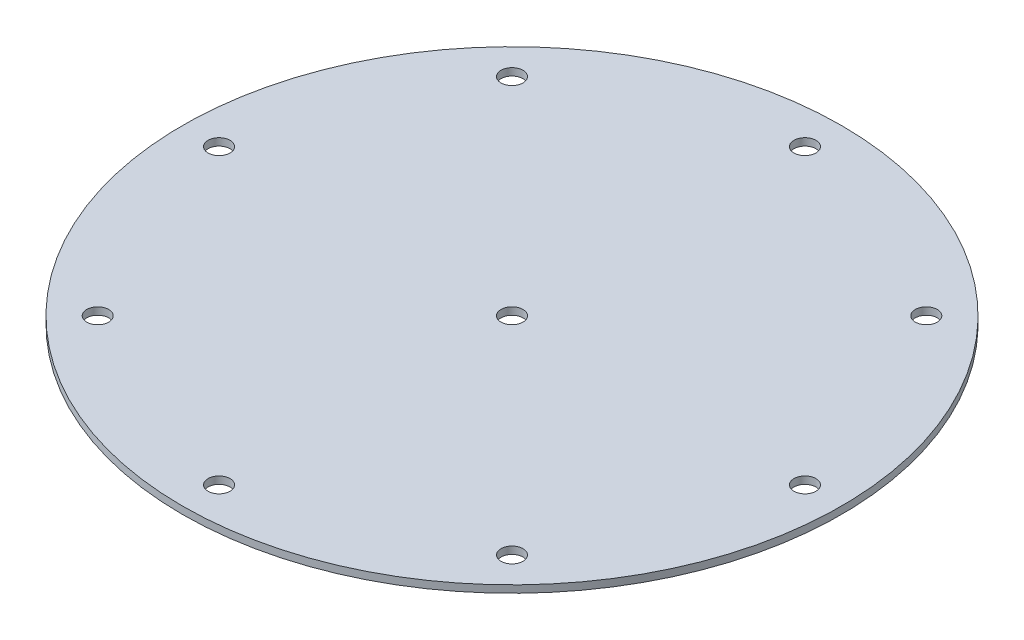
ISO-10303-21;
HEADER;
FILE_DESCRIPTION(('STEP AP214'),'2;1');
FILE_NAME('part.step','',(''),(''),'','','');
FILE_SCHEMA(('AUTOMOTIVE_DESIGN { 1 0 10303 214 1 1 1 1 }'));
ENDSEC;
DATA;
#1=APPLICATION_CONTEXT('core data for automotive mechanical design processes');
#2=APPLICATION_PROTOCOL_DEFINITION('international standard','automotive_design',2000,#1);
#3=PRODUCT_CONTEXT('',#1,'mechanical');
#4=PRODUCT('Part','Part','',(#3));
#5=PRODUCT_RELATED_PRODUCT_CATEGORY('part','',(#4));
#6=PRODUCT_DEFINITION_FORMATION('','',#4);
#7=PRODUCT_DEFINITION_CONTEXT('part definition',#1,'design');
#8=PRODUCT_DEFINITION('design','',#6,#7);
#9=PRODUCT_DEFINITION_SHAPE('','',#8);
#10=(LENGTH_UNIT() NAMED_UNIT(*) SI_UNIT(.MILLI.,.METRE.));
#11=(NAMED_UNIT(*) PLANE_ANGLE_UNIT() SI_UNIT($,.RADIAN.));
#12=(NAMED_UNIT(*) SI_UNIT($,.STERADIAN.) SOLID_ANGLE_UNIT());
#13=UNCERTAINTY_MEASURE_WITH_UNIT(LENGTH_MEASURE(1.E-05),#10,'distance_accuracy_value','');
#14=(GEOMETRIC_REPRESENTATION_CONTEXT(3) GLOBAL_UNCERTAINTY_ASSIGNED_CONTEXT((#13)) GLOBAL_UNIT_ASSIGNED_CONTEXT((#10,
#11,#12)) REPRESENTATION_CONTEXT('',''));
#15=CARTESIAN_POINT('',(0.,0.,0.));
#16=DIRECTION('',(0.,0.,1.));
#17=DIRECTION('',(1.,0.,0.));
#18=AXIS2_PLACEMENT_3D('',#15,#16,#17);
#19=CARTESIAN_POINT('',(0.,2.,0.));
#20=DIRECTION('',(0.,1.,0.));
#21=DIRECTION('',(0.,0.,1.));
#22=AXIS2_PLACEMENT_3D('',#19,#20,#21);
#23=PLANE('',#22);
#24=CARTESIAN_POINT('',(-79.9999999999875,2.,1.25055521493778E-11));
#25=DIRECTION('',(0.,1.,0.));
#26=DIRECTION('',(0.,0.,1.));
#27=AXIS2_PLACEMENT_3D('',#24,#25,#26);
#28=CIRCLE('',#27,3.00000000001641);
#29=CARTESIAN_POINT('',(-79.9999999999875,2.,3.00000000002892));
#30=VERTEX_POINT('',#29);
#31=EDGE_CURVE('E84',#30,#30,#28,.T.);
#32=ORIENTED_EDGE('',*,*,#31,.F.);
#33=EDGE_LOOP('',(#32));
#34=FACE_BOUND('',#33,.T.);
#35=CARTESIAN_POINT('',(2.49915099499692E-11,2.,80.));
#36=DIRECTION('',(0.,1.,0.));
#37=DIRECTION('',(0.,0.,1.));
#38=AXIS2_PLACEMENT_3D('',#35,#36,#37);
#39=CIRCLE('',#38,3.00000000002444);
#40=CARTESIAN_POINT('',(2.49915099499692E-11,2.,83.0000000000244));
#41=VERTEX_POINT('',#40);
#42=EDGE_CURVE('E72',#41,#41,#39,.T.);
#43=ORIENTED_EDGE('',*,*,#42,.F.);
#44=EDGE_LOOP('',(#43));
#45=FACE_BOUND('',#44,.T.);
#46=CARTESIAN_POINT('',(80.0000000000125,2.,-1.24957549749846E-11));
#47=DIRECTION('',(0.,1.,0.));
#48=DIRECTION('',(0.,0.,1.));
#49=AXIS2_PLACEMENT_3D('',#46,#47,#48);
#50=CIRCLE('',#49,3.00000000000857);
#51=CARTESIAN_POINT('',(80.0000000000125,2.,2.99999999999607));
#52=VERTEX_POINT('',#51);
#53=EDGE_CURVE('E60',#52,#52,#50,.T.);
#54=ORIENTED_EDGE('',*,*,#53,.F.);
#55=EDGE_LOOP('',(#54));
#56=FACE_BOUND('',#55,.T.);
#57=CARTESIAN_POINT('',(0.,2.,-80.));
#58=DIRECTION('',(0.,1.,0.));
#59=DIRECTION('',(0.,0.,1.));
#60=AXIS2_PLACEMENT_3D('',#57,#58,#59);
#61=CIRCLE('',#60,3.);
#62=CARTESIAN_POINT('',(0.,2.,-77.));
#63=VERTEX_POINT('',#62);
#64=EDGE_CURVE('E48',#63,#63,#61,.T.);
#65=ORIENTED_EDGE('',*,*,#64,.F.);
#66=EDGE_LOOP('',(#65));
#67=FACE_BOUND('',#66,.T.);
#68=CARTESIAN_POINT('',(0.,2.,0.));
#69=DIRECTION('',(0.,1.,0.));
#70=DIRECTION('',(0.,0.,1.));
#71=AXIS2_PLACEMENT_3D('',#68,#69,#70);
#72=CIRCLE('',#71,90.);
#73=CARTESIAN_POINT('',(0.,2.,90.));
#74=VERTEX_POINT('',#73);
#75=EDGE_CURVE('E10',#74,#74,#72,.T.);
#76=ORIENTED_EDGE('',*,*,#75,.T.);
#77=EDGE_LOOP('',(#76));
#78=FACE_BOUND('',#77,.T.);
#79=CARTESIAN_POINT('',(0.,2.,0.));
#80=DIRECTION('',(0.,1.,0.));
#81=DIRECTION('',(0.,0.,1.));
#82=AXIS2_PLACEMENT_3D('',#79,#80,#81);
#83=CIRCLE('',#82,3.);
#84=CARTESIAN_POINT('',(0.,2.,3.));
#85=VERTEX_POINT('',#84);
#86=EDGE_CURVE('E43',#85,#85,#83,.T.);
#87=ORIENTED_EDGE('',*,*,#86,.F.);
#88=EDGE_LOOP('',(#87));
#89=FACE_BOUND('',#88,.T.);
#90=CARTESIAN_POINT('',(56.5685424949274,2.,-56.5685424949326));
#91=DIRECTION('',(0.,1.,0.));
#92=DIRECTION('',(0.,0.,1.));
#93=AXIS2_PLACEMENT_3D('',#90,#91,#92);
#94=CIRCLE('',#93,3.00000000000107);
#95=CARTESIAN_POINT('',(56.5685424949274,2.,-53.5685424949316));
#96=VERTEX_POINT('',#95);
#97=EDGE_CURVE('E54',#96,#96,#94,.T.);
#98=ORIENTED_EDGE('',*,*,#97,.F.);
#99=EDGE_LOOP('',(#98));
#100=FACE_BOUND('',#99,.T.);
#101=CARTESIAN_POINT('',(56.5685424949451,2.,56.568542494915));
#102=DIRECTION('',(0.,1.,0.));
#103=DIRECTION('',(0.,0.,1.));
#104=AXIS2_PLACEMENT_3D('',#101,#102,#103);
#105=CIRCLE('',#104,3.00000000001822);
#106=CARTESIAN_POINT('',(56.5685424949451,2.,59.5685424949332));
#107=VERTEX_POINT('',#106);
#108=EDGE_CURVE('E66',#107,#107,#105,.T.);
#109=ORIENTED_EDGE('',*,*,#108,.F.);
#110=EDGE_LOOP('',(#109));
#111=FACE_BOUND('',#110,.T.);
#112=CARTESIAN_POINT('',(-56.5685424949025,2.,56.5685424949327));
#113=DIRECTION('',(0.,1.,0.));
#114=DIRECTION('',(0.,0.,1.));
#115=AXIS2_PLACEMENT_3D('',#112,#113,#114);
#116=CIRCLE('',#115,3.00000000002365);
#117=CARTESIAN_POINT('',(-56.5685424949025,2.,59.5685424949563));
#118=VERTEX_POINT('',#117);
#119=EDGE_CURVE('E78',#118,#118,#116,.T.);
#120=ORIENTED_EDGE('',*,*,#119,.F.);
#121=EDGE_LOOP('',(#120));
#122=FACE_BOUND('',#121,.T.);
#123=CARTESIAN_POINT('',(-56.5685424949202,2.,-56.568542494915));
#124=DIRECTION('',(0.,1.,0.));
#125=DIRECTION('',(0.,0.,1.));
#126=AXIS2_PLACEMENT_3D('',#123,#124,#125);
#127=CIRCLE('',#126,3.00000000000703);
#128=CARTESIAN_POINT('',(-56.5685424949202,2.,-53.5685424949079));
#129=VERTEX_POINT('',#128);
#130=EDGE_CURVE('E90',#129,#129,#127,.T.);
#131=ORIENTED_EDGE('',*,*,#130,.F.);
#132=EDGE_LOOP('',(#131));
#133=FACE_BOUND('',#132,.T.);
#134=ADVANCED_FACE('F32',(#34,#45,#56,#67,#78,#89,#100,#111,#122,#133),#23,.T.);
#135=CARTESIAN_POINT('',(0.,0.,0.));
#136=DIRECTION('',(0.,1.,0.));
#137=DIRECTION('',(0.,0.,1.));
#138=AXIS2_PLACEMENT_3D('',#135,#136,#137);
#139=PLANE('',#138);
#140=CARTESIAN_POINT('',(0.,0.,0.));
#141=DIRECTION('',(0.,1.,0.));
#142=DIRECTION('',(0.,0.,1.));
#143=AXIS2_PLACEMENT_3D('',#140,#141,#142);
#144=CIRCLE('',#143,90.);
#145=CARTESIAN_POINT('',(0.,0.,90.));
#146=VERTEX_POINT('',#145);
#147=EDGE_CURVE('E36',#146,#146,#144,.T.);
#148=ORIENTED_EDGE('',*,*,#147,.F.);
#149=EDGE_LOOP('',(#148));
#150=FACE_BOUND('',#149,.T.);
#151=CARTESIAN_POINT('',(0.,0.,0.));
#152=DIRECTION('',(0.,1.,0.));
#153=DIRECTION('',(0.,0.,1.));
#154=AXIS2_PLACEMENT_3D('',#151,#152,#153);
#155=CIRCLE('',#154,3.);
#156=CARTESIAN_POINT('',(0.,0.,3.));
#157=VERTEX_POINT('',#156);
#158=EDGE_CURVE('E45',#157,#157,#155,.T.);
#159=ORIENTED_EDGE('',*,*,#158,.T.);
#160=EDGE_LOOP('',(#159));
#161=FACE_BOUND('',#160,.T.);
#162=CARTESIAN_POINT('',(0.,0.,-80.));
#163=DIRECTION('',(0.,1.,0.));
#164=DIRECTION('',(0.,0.,1.));
#165=AXIS2_PLACEMENT_3D('',#162,#163,#164);
#166=CIRCLE('',#165,3.);
#167=CARTESIAN_POINT('',(0.,0.,-77.));
#168=VERTEX_POINT('',#167);
#169=EDGE_CURVE('E51',#168,#168,#166,.T.);
#170=ORIENTED_EDGE('',*,*,#169,.T.);
#171=EDGE_LOOP('',(#170));
#172=FACE_BOUND('',#171,.T.);
#173=CARTESIAN_POINT('',(56.5685424949274,0.,-56.5685424949326));
#174=DIRECTION('',(0.,1.,0.));
#175=DIRECTION('',(0.,0.,1.));
#176=AXIS2_PLACEMENT_3D('',#173,#174,#175);
#177=CIRCLE('',#176,3.00000000000107);
#178=CARTESIAN_POINT('',(56.5685424949274,0.,-53.5685424949316));
#179=VERTEX_POINT('',#178);
#180=EDGE_CURVE('E57',#179,#179,#177,.T.);
#181=ORIENTED_EDGE('',*,*,#180,.T.);
#182=EDGE_LOOP('',(#181));
#183=FACE_BOUND('',#182,.T.);
#184=CARTESIAN_POINT('',(80.0000000000125,0.,-1.24957549749846E-11));
#185=DIRECTION('',(0.,1.,0.));
#186=DIRECTION('',(0.,0.,1.));
#187=AXIS2_PLACEMENT_3D('',#184,#185,#186);
#188=CIRCLE('',#187,3.00000000000857);
#189=CARTESIAN_POINT('',(80.0000000000125,0.,2.99999999999607));
#190=VERTEX_POINT('',#189);
#191=EDGE_CURVE('E63',#190,#190,#188,.T.);
#192=ORIENTED_EDGE('',*,*,#191,.T.);
#193=EDGE_LOOP('',(#192));
#194=FACE_BOUND('',#193,.T.);
#195=CARTESIAN_POINT('',(56.5685424949451,0.,56.568542494915));
#196=DIRECTION('',(0.,1.,0.));
#197=DIRECTION('',(0.,0.,1.));
#198=AXIS2_PLACEMENT_3D('',#195,#196,#197);
#199=CIRCLE('',#198,3.00000000001822);
#200=CARTESIAN_POINT('',(56.5685424949451,0.,59.5685424949332));
#201=VERTEX_POINT('',#200);
#202=EDGE_CURVE('E69',#201,#201,#199,.T.);
#203=ORIENTED_EDGE('',*,*,#202,.T.);
#204=EDGE_LOOP('',(#203));
#205=FACE_BOUND('',#204,.T.);
#206=CARTESIAN_POINT('',(2.49915099499692E-11,0.,80.));
#207=DIRECTION('',(0.,1.,0.));
#208=DIRECTION('',(0.,0.,1.));
#209=AXIS2_PLACEMENT_3D('',#206,#207,#208);
#210=CIRCLE('',#209,3.00000000002444);
#211=CARTESIAN_POINT('',(2.49915099499692E-11,0.,83.0000000000244));
#212=VERTEX_POINT('',#211);
#213=EDGE_CURVE('E75',#212,#212,#210,.T.);
#214=ORIENTED_EDGE('',*,*,#213,.T.);
#215=EDGE_LOOP('',(#214));
#216=FACE_BOUND('',#215,.T.);
#217=CARTESIAN_POINT('',(-56.5685424949025,0.,56.5685424949327));
#218=DIRECTION('',(0.,1.,0.));
#219=DIRECTION('',(0.,0.,1.));
#220=AXIS2_PLACEMENT_3D('',#217,#218,#219);
#221=CIRCLE('',#220,3.00000000002365);
#222=CARTESIAN_POINT('',(-56.5685424949025,0.,59.5685424949563));
#223=VERTEX_POINT('',#222);
#224=EDGE_CURVE('E81',#223,#223,#221,.T.);
#225=ORIENTED_EDGE('',*,*,#224,.T.);
#226=EDGE_LOOP('',(#225));
#227=FACE_BOUND('',#226,.T.);
#228=CARTESIAN_POINT('',(-79.9999999999875,0.,1.25055521493778E-11));
#229=DIRECTION('',(0.,1.,0.));
#230=DIRECTION('',(0.,0.,1.));
#231=AXIS2_PLACEMENT_3D('',#228,#229,#230);
#232=CIRCLE('',#231,3.00000000001641);
#233=CARTESIAN_POINT('',(-79.9999999999875,0.,3.00000000002892));
#234=VERTEX_POINT('',#233);
#235=EDGE_CURVE('E87',#234,#234,#232,.T.);
#236=ORIENTED_EDGE('',*,*,#235,.T.);
#237=EDGE_LOOP('',(#236));
#238=FACE_BOUND('',#237,.T.);
#239=CARTESIAN_POINT('',(-56.5685424949202,0.,-56.568542494915));
#240=DIRECTION('',(0.,1.,0.));
#241=DIRECTION('',(0.,0.,1.));
#242=AXIS2_PLACEMENT_3D('',#239,#240,#241);
#243=CIRCLE('',#242,3.00000000000703);
#244=CARTESIAN_POINT('',(-56.5685424949202,0.,-53.5685424949079));
#245=VERTEX_POINT('',#244);
#246=EDGE_CURVE('E93',#245,#245,#243,.T.);
#247=ORIENTED_EDGE('',*,*,#246,.T.);
#248=EDGE_LOOP('',(#247));
#249=FACE_BOUND('',#248,.T.);
#250=ADVANCED_FACE('F103',(#150,#161,#172,#183,#194,#205,#216,#227,#238,#249),#139,.F.);
#251=CARTESIAN_POINT('',(0.,2.,0.));
#252=DIRECTION('',(0.,-1.,0.));
#253=DIRECTION('',(0.,0.,-1.));
#254=AXIS2_PLACEMENT_3D('',#251,#252,#253);
#255=CYLINDRICAL_SURFACE('',#254,90.);
#256=ORIENTED_EDGE('',*,*,#75,.F.);
#257=EDGE_LOOP('',(#256));
#258=FACE_BOUND('',#257,.T.);
#259=ORIENTED_EDGE('',*,*,#147,.T.);
#260=EDGE_LOOP('',(#259));
#261=FACE_BOUND('',#260,.T.);
#262=ADVANCED_FACE('F34',(#258,#261),#255,.T.);
#263=CARTESIAN_POINT('',(0.,2.,0.));
#264=DIRECTION('',(0.,-1.,0.));
#265=DIRECTION('',(0.,0.,-1.));
#266=AXIS2_PLACEMENT_3D('',#263,#264,#265);
#267=CYLINDRICAL_SURFACE('',#266,3.);
#268=ORIENTED_EDGE('',*,*,#86,.T.);
#269=EDGE_LOOP('',(#268));
#270=FACE_BOUND('',#269,.T.);
#271=ORIENTED_EDGE('',*,*,#158,.F.);
#272=EDGE_LOOP('',(#271));
#273=FACE_BOUND('',#272,.T.);
#274=ADVANCED_FACE('F113',(#270,#273),#267,.F.);
#275=CARTESIAN_POINT('',(0.,2.,-80.));
#276=DIRECTION('',(0.,-1.,0.));
#277=DIRECTION('',(0.,0.,-1.));
#278=AXIS2_PLACEMENT_3D('',#275,#276,#277);
#279=CYLINDRICAL_SURFACE('',#278,3.);
#280=ORIENTED_EDGE('',*,*,#64,.T.);
#281=EDGE_LOOP('',(#280));
#282=FACE_BOUND('',#281,.T.);
#283=ORIENTED_EDGE('',*,*,#169,.F.);
#284=EDGE_LOOP('',(#283));
#285=FACE_BOUND('',#284,.T.);
#286=ADVANCED_FACE('F116',(#282,#285),#279,.F.);
#287=CARTESIAN_POINT('',(56.5685424949274,2.,-56.5685424949326));
#288=DIRECTION('',(0.,-1.,0.));
#289=DIRECTION('',(0.,0.,-1.));
#290=AXIS2_PLACEMENT_3D('',#287,#288,#289);
#291=CYLINDRICAL_SURFACE('',#290,3.00000000000107);
#292=ORIENTED_EDGE('',*,*,#97,.T.);
#293=EDGE_LOOP('',(#292));
#294=FACE_BOUND('',#293,.T.);
#295=ORIENTED_EDGE('',*,*,#180,.F.);
#296=EDGE_LOOP('',(#295));
#297=FACE_BOUND('',#296,.T.);
#298=ADVANCED_FACE('F120',(#294,#297),#291,.F.);
#299=CARTESIAN_POINT('',(80.0000000000125,2.,-1.24957549749846E-11));
#300=DIRECTION('',(0.,-1.,0.));
#301=DIRECTION('',(0.,0.,-1.));
#302=AXIS2_PLACEMENT_3D('',#299,#300,#301);
#303=CYLINDRICAL_SURFACE('',#302,3.00000000000857);
#304=ORIENTED_EDGE('',*,*,#53,.T.);
#305=EDGE_LOOP('',(#304));
#306=FACE_BOUND('',#305,.T.);
#307=ORIENTED_EDGE('',*,*,#191,.F.);
#308=EDGE_LOOP('',(#307));
#309=FACE_BOUND('',#308,.T.);
#310=ADVANCED_FACE('F124',(#306,#309),#303,.F.);
#311=CARTESIAN_POINT('',(56.5685424949451,2.,56.568542494915));
#312=DIRECTION('',(0.,-1.,0.));
#313=DIRECTION('',(0.,0.,-1.));
#314=AXIS2_PLACEMENT_3D('',#311,#312,#313);
#315=CYLINDRICAL_SURFACE('',#314,3.00000000001822);
#316=ORIENTED_EDGE('',*,*,#108,.T.);
#317=EDGE_LOOP('',(#316));
#318=FACE_BOUND('',#317,.T.);
#319=ORIENTED_EDGE('',*,*,#202,.F.);
#320=EDGE_LOOP('',(#319));
#321=FACE_BOUND('',#320,.T.);
#322=ADVANCED_FACE('F128',(#318,#321),#315,.F.);
#323=CARTESIAN_POINT('',(2.49915099499692E-11,2.,80.));
#324=DIRECTION('',(0.,-1.,0.));
#325=DIRECTION('',(0.,0.,-1.));
#326=AXIS2_PLACEMENT_3D('',#323,#324,#325);
#327=CYLINDRICAL_SURFACE('',#326,3.00000000002444);
#328=ORIENTED_EDGE('',*,*,#42,.T.);
#329=EDGE_LOOP('',(#328));
#330=FACE_BOUND('',#329,.T.);
#331=ORIENTED_EDGE('',*,*,#213,.F.);
#332=EDGE_LOOP('',(#331));
#333=FACE_BOUND('',#332,.T.);
#334=ADVANCED_FACE('F132',(#330,#333),#327,.F.);
#335=CARTESIAN_POINT('',(-56.5685424949025,2.,56.5685424949327));
#336=DIRECTION('',(0.,-1.,0.));
#337=DIRECTION('',(0.,0.,-1.));
#338=AXIS2_PLACEMENT_3D('',#335,#336,#337);
#339=CYLINDRICAL_SURFACE('',#338,3.00000000002365);
#340=ORIENTED_EDGE('',*,*,#119,.T.);
#341=EDGE_LOOP('',(#340));
#342=FACE_BOUND('',#341,.T.);
#343=ORIENTED_EDGE('',*,*,#224,.F.);
#344=EDGE_LOOP('',(#343));
#345=FACE_BOUND('',#344,.T.);
#346=ADVANCED_FACE('F136',(#342,#345),#339,.F.);
#347=CARTESIAN_POINT('',(-79.9999999999875,2.,1.25055521493778E-11));
#348=DIRECTION('',(0.,-1.,0.));
#349=DIRECTION('',(0.,0.,-1.));
#350=AXIS2_PLACEMENT_3D('',#347,#348,#349);
#351=CYLINDRICAL_SURFACE('',#350,3.00000000001641);
#352=ORIENTED_EDGE('',*,*,#31,.T.);
#353=EDGE_LOOP('',(#352));
#354=FACE_BOUND('',#353,.T.);
#355=ORIENTED_EDGE('',*,*,#235,.F.);
#356=EDGE_LOOP('',(#355));
#357=FACE_BOUND('',#356,.T.);
#358=ADVANCED_FACE('F140',(#354,#357),#351,.F.);
#359=CARTESIAN_POINT('',(-56.5685424949202,2.,-56.568542494915));
#360=DIRECTION('',(0.,-1.,0.));
#361=DIRECTION('',(0.,0.,-1.));
#362=AXIS2_PLACEMENT_3D('',#359,#360,#361);
#363=CYLINDRICAL_SURFACE('',#362,3.00000000000703);
#364=ORIENTED_EDGE('',*,*,#130,.T.);
#365=EDGE_LOOP('',(#364));
#366=FACE_BOUND('',#365,.T.);
#367=ORIENTED_EDGE('',*,*,#246,.F.);
#368=EDGE_LOOP('',(#367));
#369=FACE_BOUND('',#368,.T.);
#370=ADVANCED_FACE('F99',(#366,#369),#363,.F.);
#371=CLOSED_SHELL('',(#134,#250,#262,#274,#286,#298,#310,#322,#334,#346,#358,#370));
#372=MANIFOLD_SOLID_BREP('B2',#371);
#373=ADVANCED_BREP_SHAPE_REPRESENTATION('',(#18,#372),#14);
#374=SHAPE_DEFINITION_REPRESENTATION(#9,#373);
ENDSEC;
END-ISO-10303-21;
